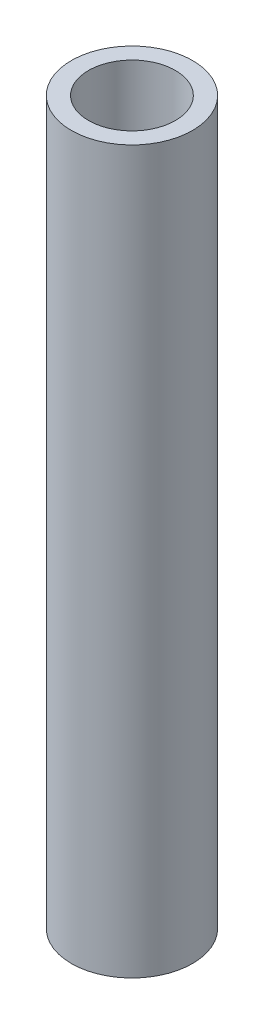
ISO-10303-21;
HEADER;
FILE_DESCRIPTION(('STEP AP214'),'2;1');
FILE_NAME('part.step','',(''),(''),'','','');
FILE_SCHEMA(('AUTOMOTIVE_DESIGN { 1 0 10303 214 1 1 1 1 }'));
ENDSEC;
DATA;
#1=APPLICATION_CONTEXT('core data for automotive mechanical design processes');
#2=APPLICATION_PROTOCOL_DEFINITION('international standard','automotive_design',2000,#1);
#3=PRODUCT_CONTEXT('',#1,'mechanical');
#4=PRODUCT('Part','Part','',(#3));
#5=PRODUCT_RELATED_PRODUCT_CATEGORY('part','',(#4));
#6=PRODUCT_DEFINITION_FORMATION('','',#4);
#7=PRODUCT_DEFINITION_CONTEXT('part definition',#1,'design');
#8=PRODUCT_DEFINITION('design','',#6,#7);
#9=PRODUCT_DEFINITION_SHAPE('','',#8);
#10=(LENGTH_UNIT() NAMED_UNIT(*) SI_UNIT(.MILLI.,.METRE.));
#11=(NAMED_UNIT(*) PLANE_ANGLE_UNIT() SI_UNIT($,.RADIAN.));
#12=(NAMED_UNIT(*) SI_UNIT($,.STERADIAN.) SOLID_ANGLE_UNIT());
#13=UNCERTAINTY_MEASURE_WITH_UNIT(LENGTH_MEASURE(1.E-05),#10,'distance_accuracy_value','');
#14=(GEOMETRIC_REPRESENTATION_CONTEXT(3) GLOBAL_UNCERTAINTY_ASSIGNED_CONTEXT((#13)) GLOBAL_UNIT_ASSIGNED_CONTEXT((#10,
#11,#12)) REPRESENTATION_CONTEXT('',''));
#15=CARTESIAN_POINT('',(0.,0.,0.));
#16=DIRECTION('',(0.,0.,1.));
#17=DIRECTION('',(1.,0.,0.));
#18=AXIS2_PLACEMENT_3D('',#15,#16,#17);
#19=CARTESIAN_POINT('',(0.,127.,0.));
#20=DIRECTION('',(0.,1.,0.));
#21=DIRECTION('',(0.,0.,1.));
#22=AXIS2_PLACEMENT_3D('',#19,#20,#21);
#23=PLANE('',#22);
#24=CARTESIAN_POINT('',(0.,127.,0.));
#25=DIRECTION('',(0.,1.,0.));
#26=DIRECTION('',(0.,0.,1.));
#27=AXIS2_PLACEMENT_3D('',#24,#25,#26);
#28=CIRCLE('',#27,10.668);
#29=CARTESIAN_POINT('',(0.,127.,10.668));
#30=VERTEX_POINT('',#29);
#31=EDGE_CURVE('E10',#30,#30,#28,.T.);
#32=ORIENTED_EDGE('',*,*,#31,.T.);
#33=EDGE_LOOP('',(#32));
#34=FACE_BOUND('',#33,.T.);
#35=CARTESIAN_POINT('',(0.,127.,0.));
#36=DIRECTION('',(0.,1.,0.));
#37=DIRECTION('',(0.,0.,1.));
#38=AXIS2_PLACEMENT_3D('',#35,#36,#37);
#39=CIRCLE('',#38,7.6454);
#40=CARTESIAN_POINT('',(0.,127.,7.6454));
#41=VERTEX_POINT('',#40);
#42=EDGE_CURVE('E62',#41,#41,#39,.T.);
#43=ORIENTED_EDGE('',*,*,#42,.F.);
#44=EDGE_LOOP('',(#43));
#45=FACE_BOUND('',#44,.T.);
#46=ADVANCED_FACE('F49',(#34,#45),#23,.T.);
#47=CARTESIAN_POINT('',(0.,0.,0.));
#48=DIRECTION('',(0.,1.,0.));
#49=DIRECTION('',(0.,0.,1.));
#50=AXIS2_PLACEMENT_3D('',#47,#48,#49);
#51=PLANE('',#50);
#52=CARTESIAN_POINT('',(0.,0.,0.));
#53=DIRECTION('',(0.,1.,0.));
#54=DIRECTION('',(0.,0.,1.));
#55=AXIS2_PLACEMENT_3D('',#52,#53,#54);
#56=CIRCLE('',#55,10.668);
#57=CARTESIAN_POINT('',(0.,0.,10.668));
#58=VERTEX_POINT('',#57);
#59=EDGE_CURVE('E53',#58,#58,#56,.T.);
#60=ORIENTED_EDGE('',*,*,#59,.F.);
#61=EDGE_LOOP('',(#60));
#62=FACE_BOUND('',#61,.T.);
#63=CARTESIAN_POINT('',(0.,0.,0.));
#64=DIRECTION('',(0.,1.,0.));
#65=DIRECTION('',(0.,0.,1.));
#66=AXIS2_PLACEMENT_3D('',#63,#64,#65);
#67=CIRCLE('',#66,7.6454);
#68=CARTESIAN_POINT('',(0.,0.,7.6454));
#69=VERTEX_POINT('',#68);
#70=EDGE_CURVE('E64',#69,#69,#67,.T.);
#71=ORIENTED_EDGE('',*,*,#70,.T.);
#72=EDGE_LOOP('',(#71));
#73=FACE_BOUND('',#72,.T.);
#74=ADVANCED_FACE('F76',(#62,#73),#51,.F.);
#75=CARTESIAN_POINT('',(0.,127.,0.));
#76=DIRECTION('',(0.,-1.,0.));
#77=DIRECTION('',(0.,0.,-1.));
#78=AXIS2_PLACEMENT_3D('',#75,#76,#77);
#79=CYLINDRICAL_SURFACE('',#78,10.668);
#80=ORIENTED_EDGE('',*,*,#31,.F.);
#81=EDGE_LOOP('',(#80));
#82=FACE_BOUND('',#81,.T.);
#83=ORIENTED_EDGE('',*,*,#59,.T.);
#84=EDGE_LOOP('',(#83));
#85=FACE_BOUND('',#84,.T.);
#86=ADVANCED_FACE('F51',(#82,#85),#79,.T.);
#87=CARTESIAN_POINT('',(0.,127.,0.));
#88=DIRECTION('',(0.,-1.,0.));
#89=DIRECTION('',(0.,0.,-1.));
#90=AXIS2_PLACEMENT_3D('',#87,#88,#89);
#91=CYLINDRICAL_SURFACE('',#90,7.6454);
#92=ORIENTED_EDGE('',*,*,#42,.T.);
#93=EDGE_LOOP('',(#92));
#94=FACE_BOUND('',#93,.T.);
#95=ORIENTED_EDGE('',*,*,#70,.F.);
#96=EDGE_LOOP('',(#95));
#97=FACE_BOUND('',#96,.T.);
#98=ADVANCED_FACE('F72',(#94,#97),#91,.F.);
#99=CLOSED_SHELL('',(#46,#74,#86,#98));
#100=MANIFOLD_SOLID_BREP('B2',#99);
#101=ADVANCED_BREP_SHAPE_REPRESENTATION('',(#18,#100),#14);
#102=SHAPE_DEFINITION_REPRESENTATION(#9,#101);
ENDSEC;
END-ISO-10303-21;
